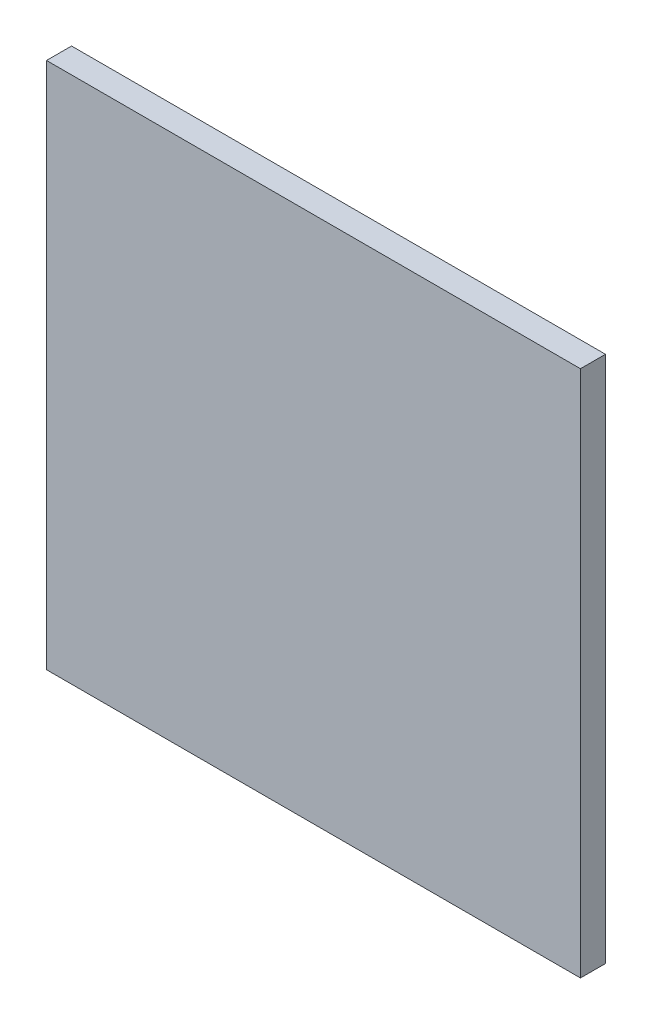
ISO-10303-21;
HEADER;
FILE_DESCRIPTION(('STEP AP214'),'2;1');
FILE_NAME('part.step','',(''),(''),'','','');
FILE_SCHEMA(('AUTOMOTIVE_DESIGN { 1 0 10303 214 1 1 1 1 }'));
ENDSEC;
DATA;
#1=APPLICATION_CONTEXT('core data for automotive mechanical design processes');
#2=APPLICATION_PROTOCOL_DEFINITION('international standard','automotive_design',2000,#1);
#3=PRODUCT_CONTEXT('',#1,'mechanical');
#4=PRODUCT('Part','Part','',(#3));
#5=PRODUCT_RELATED_PRODUCT_CATEGORY('part','',(#4));
#6=PRODUCT_DEFINITION_FORMATION('','',#4);
#7=PRODUCT_DEFINITION_CONTEXT('part definition',#1,'design');
#8=PRODUCT_DEFINITION('design','',#6,#7);
#9=PRODUCT_DEFINITION_SHAPE('','',#8);
#10=(LENGTH_UNIT() NAMED_UNIT(*) SI_UNIT(.MILLI.,.METRE.));
#11=(NAMED_UNIT(*) PLANE_ANGLE_UNIT() SI_UNIT($,.RADIAN.));
#12=(NAMED_UNIT(*) SI_UNIT($,.STERADIAN.) SOLID_ANGLE_UNIT());
#13=UNCERTAINTY_MEASURE_WITH_UNIT(LENGTH_MEASURE(1.E-05),#10,'distance_accuracy_value','');
#14=(GEOMETRIC_REPRESENTATION_CONTEXT(3) GLOBAL_UNCERTAINTY_ASSIGNED_CONTEXT((#13)) GLOBAL_UNIT_ASSIGNED_CONTEXT((#10,
#11,#12)) REPRESENTATION_CONTEXT('',''));
#15=CARTESIAN_POINT('',(0.,0.,0.));
#16=DIRECTION('',(0.,0.,1.));
#17=DIRECTION('',(1.,0.,0.));
#18=AXIS2_PLACEMENT_3D('',#15,#16,#17);
#19=CARTESIAN_POINT('',(32.,-31.625,3.));
#20=DIRECTION('',(-1.,0.,0.));
#21=DIRECTION('',(0.,0.,1.));
#22=AXIS2_PLACEMENT_3D('',#19,#20,#21);
#23=PLANE('',#22);
#24=DIRECTION('',(0.,1.,0.));
#25=VECTOR('',#24,1.);
#26=CARTESIAN_POINT('',(32.,-31.625,0.));
#27=LINE('',#26,#25);
#28=CARTESIAN_POINT('',(32.,-31.625,0.));
#29=VERTEX_POINT('',#28);
#30=CARTESIAN_POINT('',(32.,31.625,0.));
#31=VERTEX_POINT('',#30);
#32=EDGE_CURVE('E99',#29,#31,#27,.T.);
#33=ORIENTED_EDGE('',*,*,#32,.T.);
#34=DIRECTION('',(0.,0.,-1.));
#35=VECTOR('',#34,1.);
#36=CARTESIAN_POINT('',(32.,31.625,3.));
#37=LINE('',#36,#35);
#38=CARTESIAN_POINT('',(32.,31.625,3.));
#39=VERTEX_POINT('',#38);
#40=EDGE_CURVE('E11',#39,#31,#37,.T.);
#41=ORIENTED_EDGE('',*,*,#40,.F.);
#42=DIRECTION('',(0.,1.,0.));
#43=VECTOR('',#42,1.);
#44=CARTESIAN_POINT('',(32.,-31.625,3.));
#45=LINE('',#44,#43);
#46=CARTESIAN_POINT('',(32.,-31.625,3.));
#47=VERTEX_POINT('',#46);
#48=EDGE_CURVE('E87',#47,#39,#45,.T.);
#49=ORIENTED_EDGE('',*,*,#48,.F.);
#50=DIRECTION('',(0.,0.,-1.));
#51=VECTOR('',#50,1.);
#52=CARTESIAN_POINT('',(32.,-31.625,3.));
#53=LINE('',#52,#51);
#54=EDGE_CURVE('E95',#47,#29,#53,.T.);
#55=ORIENTED_EDGE('',*,*,#54,.T.);
#56=EDGE_LOOP('',(#33,#41,#49,#55));
#57=FACE_BOUND('',#56,.T.);
#58=ADVANCED_FACE('F36',(#57),#23,.F.);
#59=CARTESIAN_POINT('',(-32.,31.625,3.));
#60=DIRECTION('',(0.,-1.,0.));
#61=DIRECTION('',(0.,0.,-1.));
#62=AXIS2_PLACEMENT_3D('',#59,#60,#61);
#63=PLANE('',#62);
#64=DIRECTION('',(-1.,0.,0.));
#65=VECTOR('',#64,1.);
#66=CARTESIAN_POINT('',(-32.,31.625,0.));
#67=LINE('',#66,#65);
#68=CARTESIAN_POINT('',(-32.,31.625,0.));
#69=VERTEX_POINT('',#68);
#70=EDGE_CURVE('E91',#31,#69,#67,.T.);
#71=ORIENTED_EDGE('',*,*,#70,.T.);
#72=DIRECTION('',(0.,0.,-1.));
#73=VECTOR('',#72,1.);
#74=CARTESIAN_POINT('',(-32.,31.625,3.));
#75=LINE('',#74,#73);
#76=CARTESIAN_POINT('',(-32.,31.625,3.));
#77=VERTEX_POINT('',#76);
#78=EDGE_CURVE('E44',#77,#69,#75,.T.);
#79=ORIENTED_EDGE('',*,*,#78,.F.);
#80=DIRECTION('',(-1.,0.,0.));
#81=VECTOR('',#80,1.);
#82=CARTESIAN_POINT('',(-32.,31.625,3.));
#83=LINE('',#82,#81);
#84=EDGE_CURVE('E82',#39,#77,#83,.T.);
#85=ORIENTED_EDGE('',*,*,#84,.F.);
#86=ORIENTED_EDGE('',*,*,#40,.T.);
#87=EDGE_LOOP('',(#71,#79,#85,#86));
#88=FACE_BOUND('',#87,.T.);
#89=ADVANCED_FACE('F90',(#88),#63,.F.);
#90=CARTESIAN_POINT('',(-32.,-31.625,3.));
#91=DIRECTION('',(1.,0.,0.));
#92=DIRECTION('',(0.,0.,-1.));
#93=AXIS2_PLACEMENT_3D('',#90,#91,#92);
#94=PLANE('',#93);
#95=DIRECTION('',(0.,-1.,0.));
#96=VECTOR('',#95,1.);
#97=CARTESIAN_POINT('',(-32.,-31.625,0.));
#98=LINE('',#97,#96);
#99=CARTESIAN_POINT('',(-32.,-31.625,0.));
#100=VERTEX_POINT('',#99);
#101=EDGE_CURVE('E69',#69,#100,#98,.T.);
#102=ORIENTED_EDGE('',*,*,#101,.T.);
#103=DIRECTION('',(0.,0.,-1.));
#104=VECTOR('',#103,1.);
#105=CARTESIAN_POINT('',(-32.,-31.625,3.));
#106=LINE('',#105,#104);
#107=CARTESIAN_POINT('',(-32.,-31.625,3.));
#108=VERTEX_POINT('',#107);
#109=EDGE_CURVE('E92',#108,#100,#106,.T.);
#110=ORIENTED_EDGE('',*,*,#109,.F.);
#111=DIRECTION('',(0.,-1.,0.));
#112=VECTOR('',#111,1.);
#113=CARTESIAN_POINT('',(-32.,-31.625,3.));
#114=LINE('',#113,#112);
#115=EDGE_CURVE('E85',#77,#108,#114,.T.);
#116=ORIENTED_EDGE('',*,*,#115,.F.);
#117=ORIENTED_EDGE('',*,*,#78,.T.);
#118=EDGE_LOOP('',(#102,#110,#116,#117));
#119=FACE_BOUND('',#118,.T.);
#120=ADVANCED_FACE('F93',(#119),#94,.F.);
#121=CARTESIAN_POINT('',(-32.,-31.625,3.));
#122=DIRECTION('',(0.,1.,0.));
#123=DIRECTION('',(0.,0.,1.));
#124=AXIS2_PLACEMENT_3D('',#121,#122,#123);
#125=PLANE('',#124);
#126=DIRECTION('',(1.,0.,0.));
#127=VECTOR('',#126,1.);
#128=CARTESIAN_POINT('',(-32.,-31.625,0.));
#129=LINE('',#128,#127);
#130=EDGE_CURVE('E75',#100,#29,#129,.T.);
#131=ORIENTED_EDGE('',*,*,#130,.T.);
#132=ORIENTED_EDGE('',*,*,#54,.F.);
#133=DIRECTION('',(1.,0.,0.));
#134=VECTOR('',#133,1.);
#135=CARTESIAN_POINT('',(-32.,-31.625,3.));
#136=LINE('',#135,#134);
#137=EDGE_CURVE('E52',#108,#47,#136,.T.);
#138=ORIENTED_EDGE('',*,*,#137,.F.);
#139=ORIENTED_EDGE('',*,*,#109,.T.);
#140=EDGE_LOOP('',(#131,#132,#138,#139));
#141=FACE_BOUND('',#140,.T.);
#142=ADVANCED_FACE('F106',(#141),#125,.F.);
#143=CARTESIAN_POINT('',(0.,0.,3.));
#144=DIRECTION('',(0.,0.,-1.));
#145=DIRECTION('',(-1.,0.,0.));
#146=AXIS2_PLACEMENT_3D('',#143,#144,#145);
#147=PLANE('',#146);
#148=ORIENTED_EDGE('',*,*,#48,.T.);
#149=ORIENTED_EDGE('',*,*,#84,.T.);
#150=ORIENTED_EDGE('',*,*,#115,.T.);
#151=ORIENTED_EDGE('',*,*,#137,.T.);
#152=EDGE_LOOP('',(#148,#149,#150,#151));
#153=FACE_BOUND('',#152,.T.);
#154=ADVANCED_FACE('F83',(#153),#147,.F.);
#155=CARTESIAN_POINT('',(0.,0.,0.));
#156=DIRECTION('',(0.,0.,-1.));
#157=DIRECTION('',(-1.,0.,0.));
#158=AXIS2_PLACEMENT_3D('',#155,#156,#157);
#159=PLANE('',#158);
#160=ORIENTED_EDGE('',*,*,#32,.F.);
#161=ORIENTED_EDGE('',*,*,#130,.F.);
#162=ORIENTED_EDGE('',*,*,#101,.F.);
#163=ORIENTED_EDGE('',*,*,#70,.F.);
#164=EDGE_LOOP('',(#160,#161,#162,#163));
#165=FACE_BOUND('',#164,.T.);
#166=ADVANCED_FACE('F109',(#165),#159,.T.);
#167=CLOSED_SHELL('',(#58,#89,#120,#142,#154,#166));
#168=MANIFOLD_SOLID_BREP('B2',#167);
#169=ADVANCED_BREP_SHAPE_REPRESENTATION('',(#18,#168),#14);
#170=SHAPE_DEFINITION_REPRESENTATION(#9,#169);
ENDSEC;
END-ISO-10303-21;
